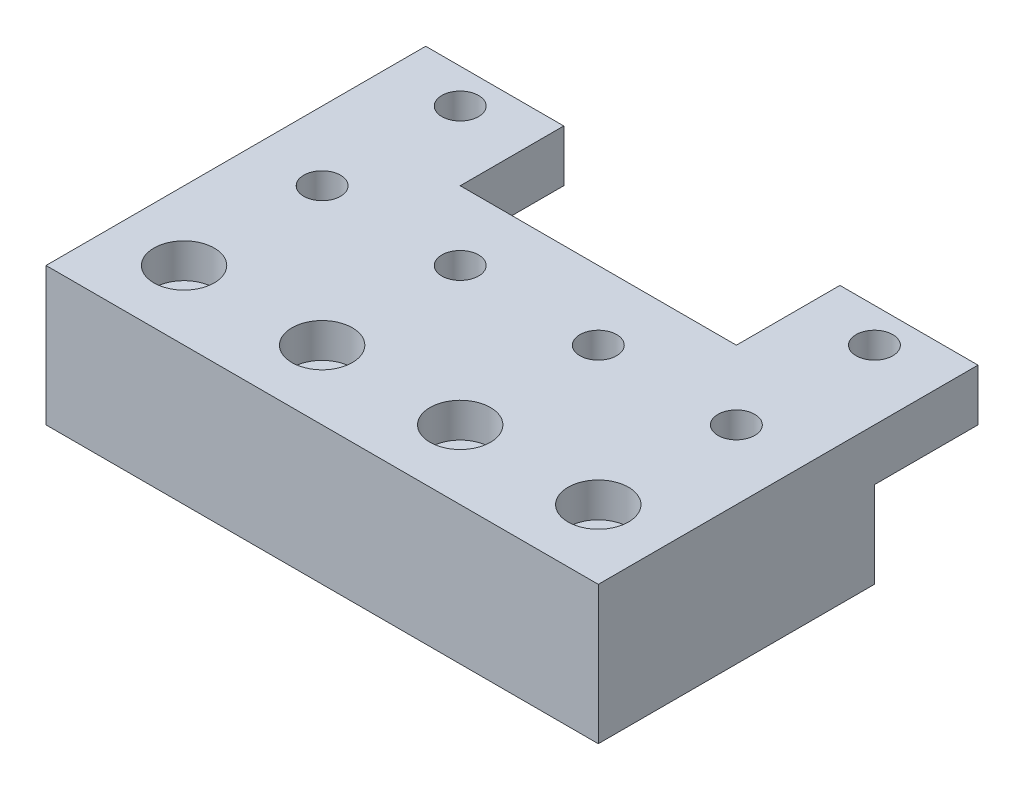
ISO-10303-21;
HEADER;
FILE_DESCRIPTION(('STEP AP214'),'2;1');
FILE_NAME('part.step','',(''),(''),'','','');
FILE_SCHEMA(('AUTOMOTIVE_DESIGN { 1 0 10303 214 1 1 1 1 }'));
ENDSEC;
DATA;
#1=APPLICATION_CONTEXT('core data for automotive mechanical design processes');
#2=APPLICATION_PROTOCOL_DEFINITION('international standard','automotive_design',2000,#1);
#3=PRODUCT_CONTEXT('',#1,'mechanical');
#4=PRODUCT('Part','Part','',(#3));
#5=PRODUCT_RELATED_PRODUCT_CATEGORY('part','',(#4));
#6=PRODUCT_DEFINITION_FORMATION('','',#4);
#7=PRODUCT_DEFINITION_CONTEXT('part definition',#1,'design');
#8=PRODUCT_DEFINITION('design','',#6,#7);
#9=PRODUCT_DEFINITION_SHAPE('','',#8);
#10=(LENGTH_UNIT() NAMED_UNIT(*) SI_UNIT(.MILLI.,.METRE.));
#11=(NAMED_UNIT(*) PLANE_ANGLE_UNIT() SI_UNIT($,.RADIAN.));
#12=(NAMED_UNIT(*) SI_UNIT($,.STERADIAN.) SOLID_ANGLE_UNIT());
#13=UNCERTAINTY_MEASURE_WITH_UNIT(LENGTH_MEASURE(1.E-05),#10,'distance_accuracy_value','');
#14=(GEOMETRIC_REPRESENTATION_CONTEXT(3) GLOBAL_UNCERTAINTY_ASSIGNED_CONTEXT((#13)) GLOBAL_UNIT_ASSIGNED_CONTEXT((#10,
#11,#12)) REPRESENTATION_CONTEXT('',''));
#15=CARTESIAN_POINT('',(0.,0.,0.));
#16=DIRECTION('',(0.,0.,1.));
#17=DIRECTION('',(1.,0.,0.));
#18=AXIS2_PLACEMENT_3D('',#15,#16,#17);
#19=CARTESIAN_POINT('',(0.,25.4,-50.8));
#20=DIRECTION('',(0.,-1.,0.));
#21=DIRECTION('',(0.,0.,-1.));
#22=AXIS2_PLACEMENT_3D('',#19,#20,#21);
#23=PLANE('',#22);
#24=CARTESIAN_POINT('',(12.7,25.4,-63.5));
#25=DIRECTION('',(0.,1.,0.));
#26=DIRECTION('',(0.,0.,1.));
#27=AXIS2_PLACEMENT_3D('',#24,#25,#26);
#28=CIRCLE('',#27,3.3782);
#29=CARTESIAN_POINT('',(12.7,25.4,-60.1218));
#30=VERTEX_POINT('',#29);
#31=EDGE_CURVE('E400',#30,#30,#28,.T.);
#32=ORIENTED_EDGE('',*,*,#31,.F.);
#33=EDGE_LOOP('',(#32));
#34=FACE_BOUND('',#33,.T.);
#35=DIRECTION('',(1.,0.,0.));
#36=VECTOR('',#35,1.);
#37=CARTESIAN_POINT('',(101.6,25.4,-69.85));
#38=LINE('',#37,#36);
#39=CARTESIAN_POINT('',(76.2,25.4,-69.85));
#40=VERTEX_POINT('',#39);
#41=CARTESIAN_POINT('',(101.6,25.4,-69.85));
#42=VERTEX_POINT('',#41);
#43=EDGE_CURVE('E280',#40,#42,#38,.T.);
#44=ORIENTED_EDGE('',*,*,#43,.F.);
#45=DIRECTION('',(0.,0.,-1.));
#46=VECTOR('',#45,1.);
#47=CARTESIAN_POINT('',(76.2,25.4,-50.8));
#48=LINE('',#47,#46);
#49=CARTESIAN_POINT('',(76.2,25.4,-50.8));
#50=VERTEX_POINT('',#49);
#51=EDGE_CURVE('E140',#50,#40,#48,.T.);
#52=ORIENTED_EDGE('',*,*,#51,.F.);
#53=DIRECTION('',(1.,0.,0.));
#54=VECTOR('',#53,1.);
#55=CARTESIAN_POINT('',(76.2,25.4,-50.8));
#56=LINE('',#55,#54);
#57=CARTESIAN_POINT('',(25.4,25.4,-50.8));
#58=VERTEX_POINT('',#57);
#59=EDGE_CURVE('E122',#58,#50,#56,.T.);
#60=ORIENTED_EDGE('',*,*,#59,.F.);
#61=DIRECTION('',(0.,0.,-1.));
#62=VECTOR('',#61,1.);
#63=CARTESIAN_POINT('',(25.4,25.4,-50.8));
#64=LINE('',#63,#62);
#65=CARTESIAN_POINT('',(25.4,25.4,-69.85));
#66=VERTEX_POINT('',#65);
#67=EDGE_CURVE('E271',#58,#66,#64,.T.);
#68=ORIENTED_EDGE('',*,*,#67,.T.);
#69=CARTESIAN_POINT('',(0.,25.4,-69.85));
#70=VERTEX_POINT('',#69);
#71=EDGE_CURVE('E151',#70,#66,#38,.T.);
#72=ORIENTED_EDGE('',*,*,#71,.F.);
#73=DIRECTION('',(0.,0.,1.));
#74=VECTOR('',#73,1.);
#75=CARTESIAN_POINT('',(0.,25.4,0.));
#76=LINE('',#75,#74);
#77=CARTESIAN_POINT('',(0.,25.4,0.));
#78=VERTEX_POINT('',#77);
#79=EDGE_CURVE('E191',#70,#78,#76,.T.);
#80=ORIENTED_EDGE('',*,*,#79,.T.);
#81=DIRECTION('',(1.,0.,0.));
#82=VECTOR('',#81,1.);
#83=CARTESIAN_POINT('',(0.,25.4,0.));
#84=LINE('',#83,#82);
#85=CARTESIAN_POINT('',(101.6,25.4,0.));
#86=VERTEX_POINT('',#85);
#87=EDGE_CURVE('E194',#78,#86,#84,.T.);
#88=ORIENTED_EDGE('',*,*,#87,.T.);
#89=DIRECTION('',(0.,0.,-1.));
#90=VECTOR('',#89,1.);
#91=CARTESIAN_POINT('',(101.6,25.4,0.));
#92=LINE('',#91,#90);
#93=EDGE_CURVE('E197',#86,#42,#92,.T.);
#94=ORIENTED_EDGE('',*,*,#93,.T.);
#95=EDGE_LOOP('',(#44,#52,#60,#68,#72,#80,#88,#94));
#96=FACE_BOUND('',#95,.T.);
#97=CARTESIAN_POINT('',(38.1,25.4,-38.1));
#98=DIRECTION('',(0.,1.,0.));
#99=DIRECTION('',(0.,0.,1.));
#100=AXIS2_PLACEMENT_3D('',#97,#98,#99);
#101=CIRCLE('',#100,3.3782);
#102=CARTESIAN_POINT('',(38.1,25.4,-34.7218));
#103=VERTEX_POINT('',#102);
#104=EDGE_CURVE('E157',#103,#103,#101,.T.);
#105=ORIENTED_EDGE('',*,*,#104,.F.);
#106=EDGE_LOOP('',(#105));
#107=FACE_BOUND('',#106,.T.);
#108=CARTESIAN_POINT('',(12.7,25.4,-38.1));
#109=DIRECTION('',(0.,1.,0.));
#110=DIRECTION('',(0.,0.,1.));
#111=AXIS2_PLACEMENT_3D('',#108,#109,#110);
#112=CIRCLE('',#111,3.3782);
#113=CARTESIAN_POINT('',(12.7,25.4,-34.7218));
#114=VERTEX_POINT('',#113);
#115=EDGE_CURVE('E160',#114,#114,#112,.T.);
#116=ORIENTED_EDGE('',*,*,#115,.F.);
#117=EDGE_LOOP('',(#116));
#118=FACE_BOUND('',#117,.T.);
#119=CARTESIAN_POINT('',(38.1,25.4,-12.7));
#120=DIRECTION('',(0.,1.,0.));
#121=DIRECTION('',(0.,0.,1.));
#122=AXIS2_PLACEMENT_3D('',#119,#120,#121);
#123=CIRCLE('',#122,5.55625);
#124=CARTESIAN_POINT('',(38.1,25.4,-7.14375));
#125=VERTEX_POINT('',#124);
#126=EDGE_CURVE('E166',#125,#125,#123,.T.);
#127=ORIENTED_EDGE('',*,*,#126,.F.);
#128=EDGE_LOOP('',(#127));
#129=FACE_BOUND('',#128,.T.);
#130=CARTESIAN_POINT('',(12.7,25.4,-12.7));
#131=DIRECTION('',(0.,1.,0.));
#132=DIRECTION('',(0.,0.,1.));
#133=AXIS2_PLACEMENT_3D('',#130,#131,#132);
#134=CIRCLE('',#133,5.55625);
#135=CARTESIAN_POINT('',(12.7,25.4,-7.14375));
#136=VERTEX_POINT('',#135);
#137=EDGE_CURVE('E178',#136,#136,#134,.T.);
#138=ORIENTED_EDGE('',*,*,#137,.F.);
#139=EDGE_LOOP('',(#138));
#140=FACE_BOUND('',#139,.T.);
#141=CARTESIAN_POINT('',(63.5,25.4,-12.7));
#142=DIRECTION('',(0.,1.,0.));
#143=DIRECTION('',(0.,0.,1.));
#144=AXIS2_PLACEMENT_3D('',#141,#142,#143);
#145=CIRCLE('',#144,5.55625);
#146=CARTESIAN_POINT('',(63.5,25.4,-7.14375));
#147=VERTEX_POINT('',#146);
#148=EDGE_CURVE('E243',#147,#147,#145,.T.);
#149=ORIENTED_EDGE('',*,*,#148,.F.);
#150=EDGE_LOOP('',(#149));
#151=FACE_BOUND('',#150,.T.);
#152=CARTESIAN_POINT('',(88.9,25.4,-12.7));
#153=DIRECTION('',(0.,1.,0.));
#154=DIRECTION('',(0.,0.,1.));
#155=AXIS2_PLACEMENT_3D('',#152,#153,#154);
#156=CIRCLE('',#155,5.55625);
#157=CARTESIAN_POINT('',(88.9,25.4,-7.14375));
#158=VERTEX_POINT('',#157);
#159=EDGE_CURVE('E231',#158,#158,#156,.T.);
#160=ORIENTED_EDGE('',*,*,#159,.F.);
#161=EDGE_LOOP('',(#160));
#162=FACE_BOUND('',#161,.T.);
#163=CARTESIAN_POINT('',(63.5,25.4,-38.1));
#164=DIRECTION('',(0.,1.,0.));
#165=DIRECTION('',(0.,0.,1.));
#166=AXIS2_PLACEMENT_3D('',#163,#164,#165);
#167=CIRCLE('',#166,3.3782);
#168=CARTESIAN_POINT('',(63.5,25.4,-34.7218));
#169=VERTEX_POINT('',#168);
#170=EDGE_CURVE('E216',#169,#169,#167,.T.);
#171=ORIENTED_EDGE('',*,*,#170,.F.);
#172=EDGE_LOOP('',(#171));
#173=FACE_BOUND('',#172,.T.);
#174=CARTESIAN_POINT('',(88.9,25.4,-38.1));
#175=DIRECTION('',(0.,1.,0.));
#176=DIRECTION('',(0.,0.,1.));
#177=AXIS2_PLACEMENT_3D('',#174,#175,#176);
#178=CIRCLE('',#177,3.3782);
#179=CARTESIAN_POINT('',(88.9,25.4,-34.7218));
#180=VERTEX_POINT('',#179);
#181=EDGE_CURVE('E11',#180,#180,#178,.T.);
#182=ORIENTED_EDGE('',*,*,#181,.F.);
#183=EDGE_LOOP('',(#182));
#184=FACE_BOUND('',#183,.T.);
#185=CARTESIAN_POINT('',(88.9,25.4,-63.5));
#186=DIRECTION('',(0.,1.,0.));
#187=DIRECTION('',(0.,0.,1.));
#188=AXIS2_PLACEMENT_3D('',#185,#186,#187);
#189=CIRCLE('',#188,3.3782);
#190=CARTESIAN_POINT('',(88.9,25.4,-60.1218));
#191=VERTEX_POINT('',#190);
#192=EDGE_CURVE('E395',#191,#191,#189,.T.);
#193=ORIENTED_EDGE('',*,*,#192,.F.);
#194=EDGE_LOOP('',(#193));
#195=FACE_BOUND('',#194,.T.);
#196=ADVANCED_FACE('F34',(#34,#96,#107,#118,#129,#140,#151,#162,#173,#184,#195),#23,.F.);
#197=CARTESIAN_POINT('',(101.6,15.875,-69.85));
#198=DIRECTION('',(0.,1.,0.));
#199=DIRECTION('',(0.,0.,1.));
#200=AXIS2_PLACEMENT_3D('',#197,#198,#199);
#201=PLANE('',#200);
#202=CARTESIAN_POINT('',(88.9,15.875,-63.5));
#203=DIRECTION('',(0.,1.,0.));
#204=DIRECTION('',(0.,0.,1.));
#205=AXIS2_PLACEMENT_3D('',#202,#203,#204);
#206=CIRCLE('',#205,3.3782);
#207=CARTESIAN_POINT('',(88.9,15.875,-60.1218));
#208=VERTEX_POINT('',#207);
#209=EDGE_CURVE('E397',#208,#208,#206,.T.);
#210=ORIENTED_EDGE('',*,*,#209,.T.);
#211=EDGE_LOOP('',(#210));
#212=FACE_BOUND('',#211,.T.);
#213=DIRECTION('',(-1.,0.,0.));
#214=VECTOR('',#213,1.);
#215=CARTESIAN_POINT('',(101.6,15.875,-50.8));
#216=LINE('',#215,#214);
#217=CARTESIAN_POINT('',(101.6,15.875,-50.8));
#218=VERTEX_POINT('',#217);
#219=CARTESIAN_POINT('',(76.2,15.875,-50.8));
#220=VERTEX_POINT('',#219);
#221=EDGE_CURVE('E60',#218,#220,#216,.T.);
#222=ORIENTED_EDGE('',*,*,#221,.T.);
#223=DIRECTION('',(0.,0.,-1.));
#224=VECTOR('',#223,1.);
#225=CARTESIAN_POINT('',(76.2,15.875,-50.8));
#226=LINE('',#225,#224);
#227=CARTESIAN_POINT('',(76.2,15.875,-69.85));
#228=VERTEX_POINT('',#227);
#229=EDGE_CURVE('E114',#220,#228,#226,.T.);
#230=ORIENTED_EDGE('',*,*,#229,.T.);
#231=DIRECTION('',(-1.,0.,0.));
#232=VECTOR('',#231,1.);
#233=CARTESIAN_POINT('',(101.6,15.875,-69.85));
#234=LINE('',#233,#232);
#235=CARTESIAN_POINT('',(101.6,15.875,-69.85));
#236=VERTEX_POINT('',#235);
#237=EDGE_CURVE('E277',#236,#228,#234,.T.);
#238=ORIENTED_EDGE('',*,*,#237,.F.);
#239=DIRECTION('',(0.,0.,1.));
#240=VECTOR('',#239,1.);
#241=CARTESIAN_POINT('',(101.6,15.875,-69.85));
#242=LINE('',#241,#240);
#243=EDGE_CURVE('E134',#236,#218,#242,.T.);
#244=ORIENTED_EDGE('',*,*,#243,.T.);
#245=EDGE_LOOP('',(#222,#230,#238,#244));
#246=FACE_BOUND('',#245,.T.);
#247=ADVANCED_FACE('F132',(#212,#246),#201,.F.);
#248=CARTESIAN_POINT('',(101.6,15.875,-69.85));
#249=DIRECTION('',(0.,0.,-1.));
#250=DIRECTION('',(-1.,0.,0.));
#251=AXIS2_PLACEMENT_3D('',#248,#249,#250);
#252=PLANE('',#251);
#253=DIRECTION('',(0.,-1.,0.));
#254=VECTOR('',#253,1.);
#255=CARTESIAN_POINT('',(76.2,25.4,-69.85));
#256=LINE('',#255,#254);
#257=EDGE_CURVE('E119',#40,#228,#256,.T.);
#258=ORIENTED_EDGE('',*,*,#257,.F.);
#259=ORIENTED_EDGE('',*,*,#43,.T.);
#260=DIRECTION('',(0.,-1.,0.));
#261=VECTOR('',#260,1.);
#262=CARTESIAN_POINT('',(101.6,25.4,-69.85));
#263=LINE('',#262,#261);
#264=EDGE_CURVE('E135',#42,#236,#263,.T.);
#265=ORIENTED_EDGE('',*,*,#264,.T.);
#266=ORIENTED_EDGE('',*,*,#237,.T.);
#267=EDGE_LOOP('',(#258,#259,#265,#266));
#268=FACE_BOUND('',#267,.T.);
#269=ADVANCED_FACE('F297',(#268),#252,.T.);
#270=CARTESIAN_POINT('',(0.,25.4,-50.8));
#271=DIRECTION('',(0.,0.,1.));
#272=DIRECTION('',(1.,0.,0.));
#273=AXIS2_PLACEMENT_3D('',#270,#271,#272);
#274=PLANE('',#273);
#275=ORIENTED_EDGE('',*,*,#221,.F.);
#276=DIRECTION('',(0.,-1.,0.));
#277=VECTOR('',#276,1.);
#278=CARTESIAN_POINT('',(101.6,25.4,-50.8));
#279=LINE('',#278,#277);
#280=CARTESIAN_POINT('',(101.6,0.,-50.8));
#281=VERTEX_POINT('',#280);
#282=EDGE_CURVE('E143',#218,#281,#279,.T.);
#283=ORIENTED_EDGE('',*,*,#282,.T.);
#284=DIRECTION('',(-1.,0.,0.));
#285=VECTOR('',#284,1.);
#286=CARTESIAN_POINT('',(0.,0.,-50.8));
#287=LINE('',#286,#285);
#288=CARTESIAN_POINT('',(0.,0.,-50.8));
#289=VERTEX_POINT('',#288);
#290=EDGE_CURVE('E195',#281,#289,#287,.T.);
#291=ORIENTED_EDGE('',*,*,#290,.T.);
#292=DIRECTION('',(0.,-1.,0.));
#293=VECTOR('',#292,1.);
#294=CARTESIAN_POINT('',(0.,25.4,-50.8));
#295=LINE('',#294,#293);
#296=CARTESIAN_POINT('',(0.,15.875,-50.8));
#297=VERTEX_POINT('',#296);
#298=EDGE_CURVE('E200',#297,#289,#295,.T.);
#299=ORIENTED_EDGE('',*,*,#298,.F.);
#300=CARTESIAN_POINT('',(25.4,15.875,-50.8));
#301=VERTEX_POINT('',#300);
#302=EDGE_CURVE('E38',#301,#297,#216,.T.);
#303=ORIENTED_EDGE('',*,*,#302,.F.);
#304=DIRECTION('',(0.,1.,0.));
#305=VECTOR('',#304,1.);
#306=CARTESIAN_POINT('',(25.4,25.4,-50.8));
#307=LINE('',#306,#305);
#308=EDGE_CURVE('E128',#301,#58,#307,.T.);
#309=ORIENTED_EDGE('',*,*,#308,.T.);
#310=ORIENTED_EDGE('',*,*,#59,.T.);
#311=DIRECTION('',(0.,-1.,0.));
#312=VECTOR('',#311,1.);
#313=CARTESIAN_POINT('',(76.2,25.4,-50.8));
#314=LINE('',#313,#312);
#315=EDGE_CURVE('E116',#50,#220,#314,.T.);
#316=ORIENTED_EDGE('',*,*,#315,.T.);
#317=EDGE_LOOP('',(#275,#283,#291,#299,#303,#309,#310,#316));
#318=FACE_BOUND('',#317,.T.);
#319=ADVANCED_FACE('F124',(#318),#274,.F.);
#320=CARTESIAN_POINT('',(0.,25.4,0.));
#321=DIRECTION('',(1.,0.,0.));
#322=DIRECTION('',(0.,0.,-1.));
#323=AXIS2_PLACEMENT_3D('',#320,#321,#322);
#324=PLANE('',#323);
#325=DIRECTION('',(0.,0.,1.));
#326=VECTOR('',#325,1.);
#327=CARTESIAN_POINT('',(0.,0.,0.));
#328=LINE('',#327,#326);
#329=CARTESIAN_POINT('',(0.,0.,0.));
#330=VERTEX_POINT('',#329);
#331=EDGE_CURVE('E190',#289,#330,#328,.T.);
#332=ORIENTED_EDGE('',*,*,#331,.T.);
#333=DIRECTION('',(0.,-1.,0.));
#334=VECTOR('',#333,1.);
#335=CARTESIAN_POINT('',(0.,25.4,0.));
#336=LINE('',#335,#334);
#337=EDGE_CURVE('E246',#78,#330,#336,.T.);
#338=ORIENTED_EDGE('',*,*,#337,.F.);
#339=ORIENTED_EDGE('',*,*,#79,.F.);
#340=DIRECTION('',(0.,1.,0.));
#341=VECTOR('',#340,1.);
#342=CARTESIAN_POINT('',(0.,25.4,-69.85));
#343=LINE('',#342,#341);
#344=CARTESIAN_POINT('',(0.,15.875,-69.85));
#345=VERTEX_POINT('',#344);
#346=EDGE_CURVE('E278',#345,#70,#343,.T.);
#347=ORIENTED_EDGE('',*,*,#346,.F.);
#348=DIRECTION('',(0.,0.,1.));
#349=VECTOR('',#348,1.);
#350=CARTESIAN_POINT('',(0.,15.875,-69.85));
#351=LINE('',#350,#349);
#352=EDGE_CURVE('E146',#345,#297,#351,.T.);
#353=ORIENTED_EDGE('',*,*,#352,.T.);
#354=ORIENTED_EDGE('',*,*,#298,.T.);
#355=EDGE_LOOP('',(#332,#338,#339,#347,#353,#354));
#356=FACE_BOUND('',#355,.T.);
#357=ADVANCED_FACE('F263',(#356),#324,.F.);
#358=CARTESIAN_POINT('',(0.,25.4,0.));
#359=DIRECTION('',(0.,0.,-1.));
#360=DIRECTION('',(-1.,0.,0.));
#361=AXIS2_PLACEMENT_3D('',#358,#359,#360);
#362=PLANE('',#361);
#363=DIRECTION('',(1.,0.,0.));
#364=VECTOR('',#363,1.);
#365=CARTESIAN_POINT('',(0.,0.,0.));
#366=LINE('',#365,#364);
#367=CARTESIAN_POINT('',(101.6,0.,0.));
#368=VERTEX_POINT('',#367);
#369=EDGE_CURVE('E203',#330,#368,#366,.T.);
#370=ORIENTED_EDGE('',*,*,#369,.T.);
#371=DIRECTION('',(0.,-1.,0.));
#372=VECTOR('',#371,1.);
#373=CARTESIAN_POINT('',(101.6,25.4,0.));
#374=LINE('',#373,#372);
#375=EDGE_CURVE('E248',#86,#368,#374,.T.);
#376=ORIENTED_EDGE('',*,*,#375,.F.);
#377=ORIENTED_EDGE('',*,*,#87,.F.);
#378=ORIENTED_EDGE('',*,*,#337,.T.);
#379=EDGE_LOOP('',(#370,#376,#377,#378));
#380=FACE_BOUND('',#379,.T.);
#381=ADVANCED_FACE('F300',(#380),#362,.F.);
#382=CARTESIAN_POINT('',(101.6,25.4,0.));
#383=DIRECTION('',(-1.,0.,0.));
#384=DIRECTION('',(0.,0.,1.));
#385=AXIS2_PLACEMENT_3D('',#382,#383,#384);
#386=PLANE('',#385);
#387=DIRECTION('',(0.,0.,-1.));
#388=VECTOR('',#387,1.);
#389=CARTESIAN_POINT('',(101.6,0.,0.));
#390=LINE('',#389,#388);
#391=EDGE_CURVE('E205',#368,#281,#390,.T.);
#392=ORIENTED_EDGE('',*,*,#391,.T.);
#393=ORIENTED_EDGE('',*,*,#282,.F.);
#394=ORIENTED_EDGE('',*,*,#243,.F.);
#395=ORIENTED_EDGE('',*,*,#264,.F.);
#396=ORIENTED_EDGE('',*,*,#93,.F.);
#397=ORIENTED_EDGE('',*,*,#375,.T.);
#398=EDGE_LOOP('',(#392,#393,#394,#395,#396,#397));
#399=FACE_BOUND('',#398,.T.);
#400=ADVANCED_FACE('F257',(#399),#386,.F.);
#401=CARTESIAN_POINT('',(0.,0.,-50.8));
#402=DIRECTION('',(0.,-1.,0.));
#403=DIRECTION('',(0.,0.,-1.));
#404=AXIS2_PLACEMENT_3D('',#401,#402,#403);
#405=PLANE('',#404);
#406=CARTESIAN_POINT('',(38.1,0.,-38.1));
#407=DIRECTION('',(0.,1.,0.));
#408=DIRECTION('',(0.,0.,1.));
#409=AXIS2_PLACEMENT_3D('',#406,#407,#408);
#410=CIRCLE('',#409,3.37819999999999);
#411=CARTESIAN_POINT('',(38.1,0.,-34.7218));
#412=VERTEX_POINT('',#411);
#413=EDGE_CURVE('E153',#412,#412,#410,.T.);
#414=ORIENTED_EDGE('',*,*,#413,.T.);
#415=EDGE_LOOP('',(#414));
#416=FACE_BOUND('',#415,.T.);
#417=CARTESIAN_POINT('',(12.7,0.,-38.1));
#418=DIRECTION('',(0.,1.,0.));
#419=DIRECTION('',(0.,0.,1.));
#420=AXIS2_PLACEMENT_3D('',#417,#418,#419);
#421=CIRCLE('',#420,3.37819999999999);
#422=CARTESIAN_POINT('',(12.7,0.,-34.7218));
#423=VERTEX_POINT('',#422);
#424=EDGE_CURVE('E163',#423,#423,#421,.T.);
#425=ORIENTED_EDGE('',*,*,#424,.T.);
#426=EDGE_LOOP('',(#425));
#427=FACE_BOUND('',#426,.T.);
#428=CARTESIAN_POINT('',(38.1,0.,-12.7));
#429=DIRECTION('',(0.,1.,0.));
#430=DIRECTION('',(0.,0.,1.));
#431=AXIS2_PLACEMENT_3D('',#428,#429,#430);
#432=CIRCLE('',#431,3.37819999999999);
#433=CARTESIAN_POINT('',(38.1,0.,-9.3218));
#434=VERTEX_POINT('',#433);
#435=EDGE_CURVE('E169',#434,#434,#432,.T.);
#436=ORIENTED_EDGE('',*,*,#435,.T.);
#437=EDGE_LOOP('',(#436));
#438=FACE_BOUND('',#437,.T.);
#439=CARTESIAN_POINT('',(12.7,0.,-12.7));
#440=DIRECTION('',(0.,1.,0.));
#441=DIRECTION('',(0.,0.,1.));
#442=AXIS2_PLACEMENT_3D('',#439,#440,#441);
#443=CIRCLE('',#442,3.37819999999999);
#444=CARTESIAN_POINT('',(12.7,0.,-9.3218));
#445=VERTEX_POINT('',#444);
#446=EDGE_CURVE('E187',#445,#445,#443,.T.);
#447=ORIENTED_EDGE('',*,*,#446,.T.);
#448=EDGE_LOOP('',(#447));
#449=FACE_BOUND('',#448,.T.);
#450=ORIENTED_EDGE('',*,*,#331,.F.);
#451=ORIENTED_EDGE('',*,*,#290,.F.);
#452=ORIENTED_EDGE('',*,*,#391,.F.);
#453=ORIENTED_EDGE('',*,*,#369,.F.);
#454=EDGE_LOOP('',(#450,#451,#452,#453));
#455=FACE_BOUND('',#454,.T.);
#456=CARTESIAN_POINT('',(63.5,0.,-12.7));
#457=DIRECTION('',(0.,1.,0.));
#458=DIRECTION('',(0.,0.,1.));
#459=AXIS2_PLACEMENT_3D('',#456,#457,#458);
#460=CIRCLE('',#459,3.37819999999999);
#461=CARTESIAN_POINT('',(63.5,0.,-9.3218));
#462=VERTEX_POINT('',#461);
#463=EDGE_CURVE('E240',#462,#462,#460,.T.);
#464=ORIENTED_EDGE('',*,*,#463,.T.);
#465=EDGE_LOOP('',(#464));
#466=FACE_BOUND('',#465,.T.);
#467=CARTESIAN_POINT('',(88.9,0.,-12.7));
#468=DIRECTION('',(0.,1.,0.));
#469=DIRECTION('',(0.,0.,1.));
#470=AXIS2_PLACEMENT_3D('',#467,#468,#469);
#471=CIRCLE('',#470,3.37819999999999);
#472=CARTESIAN_POINT('',(88.9,0.,-9.3218));
#473=VERTEX_POINT('',#472);
#474=EDGE_CURVE('E228',#473,#473,#471,.T.);
#475=ORIENTED_EDGE('',*,*,#474,.T.);
#476=EDGE_LOOP('',(#475));
#477=FACE_BOUND('',#476,.T.);
#478=CARTESIAN_POINT('',(63.5,0.,-38.1));
#479=DIRECTION('',(0.,1.,0.));
#480=DIRECTION('',(0.,0.,1.));
#481=AXIS2_PLACEMENT_3D('',#478,#479,#480);
#482=CIRCLE('',#481,3.37819999999999);
#483=CARTESIAN_POINT('',(63.5,0.,-34.7218));
#484=VERTEX_POINT('',#483);
#485=EDGE_CURVE('E219',#484,#484,#482,.T.);
#486=ORIENTED_EDGE('',*,*,#485,.T.);
#487=EDGE_LOOP('',(#486));
#488=FACE_BOUND('',#487,.T.);
#489=CARTESIAN_POINT('',(88.9,0.,-38.1));
#490=DIRECTION('',(0.,1.,0.));
#491=DIRECTION('',(0.,0.,1.));
#492=AXIS2_PLACEMENT_3D('',#489,#490,#491);
#493=CIRCLE('',#492,3.37819999999999);
#494=CARTESIAN_POINT('',(88.9,0.,-34.7218));
#495=VERTEX_POINT('',#494);
#496=EDGE_CURVE('E44',#495,#495,#493,.T.);
#497=ORIENTED_EDGE('',*,*,#496,.T.);
#498=EDGE_LOOP('',(#497));
#499=FACE_BOUND('',#498,.T.);
#500=ADVANCED_FACE('F259',(#416,#427,#438,#449,#455,#466,#477,#488,#499),#405,.T.);
#501=CARTESIAN_POINT('',(12.7,25.4,-12.7));
#502=DIRECTION('',(0.,1.,0.));
#503=DIRECTION('',(0.,0.,1.));
#504=AXIS2_PLACEMENT_3D('',#501,#502,#503);
#505=CYLINDRICAL_SURFACE('',#504,3.3782);
#506=ORIENTED_EDGE('',*,*,#446,.F.);
#507=EDGE_LOOP('',(#506));
#508=FACE_BOUND('',#507,.T.);
#509=CARTESIAN_POINT('',(12.7,19.05,-12.7));
#510=DIRECTION('',(0.,1.,0.));
#511=DIRECTION('',(0.,0.,1.));
#512=AXIS2_PLACEMENT_3D('',#509,#510,#511);
#513=CIRCLE('',#512,3.3782);
#514=CARTESIAN_POINT('',(12.7,19.05,-9.3218));
#515=VERTEX_POINT('',#514);
#516=EDGE_CURVE('E184',#515,#515,#513,.T.);
#517=ORIENTED_EDGE('',*,*,#516,.T.);
#518=EDGE_LOOP('',(#517));
#519=FACE_BOUND('',#518,.T.);
#520=ADVANCED_FACE('F320',(#508,#519),#505,.F.);
#521=CARTESIAN_POINT('',(16.0782,19.05,-12.7));
#522=DIRECTION('',(0.,-1.,0.));
#523=DIRECTION('',(0.,0.,-1.));
#524=AXIS2_PLACEMENT_3D('',#521,#522,#523);
#525=PLANE('',#524);
#526=ORIENTED_EDGE('',*,*,#516,.F.);
#527=EDGE_LOOP('',(#526));
#528=FACE_BOUND('',#527,.T.);
#529=CARTESIAN_POINT('',(12.7,19.05,-12.7));
#530=DIRECTION('',(0.,1.,0.));
#531=DIRECTION('',(0.,0.,1.));
#532=AXIS2_PLACEMENT_3D('',#529,#530,#531);
#533=CIRCLE('',#532,5.55625);
#534=CARTESIAN_POINT('',(12.7,19.05,-7.14375));
#535=VERTEX_POINT('',#534);
#536=EDGE_CURVE('E181',#535,#535,#533,.T.);
#537=ORIENTED_EDGE('',*,*,#536,.T.);
#538=EDGE_LOOP('',(#537));
#539=FACE_BOUND('',#538,.T.);
#540=ADVANCED_FACE('F370',(#528,#539),#525,.F.);
#541=CARTESIAN_POINT('',(12.7,25.4,-12.7));
#542=DIRECTION('',(0.,1.,0.));
#543=DIRECTION('',(0.,0.,1.));
#544=AXIS2_PLACEMENT_3D('',#541,#542,#543);
#545=CYLINDRICAL_SURFACE('',#544,5.55625);
#546=ORIENTED_EDGE('',*,*,#536,.F.);
#547=EDGE_LOOP('',(#546));
#548=FACE_BOUND('',#547,.T.);
#549=ORIENTED_EDGE('',*,*,#137,.T.);
#550=EDGE_LOOP('',(#549));
#551=FACE_BOUND('',#550,.T.);
#552=ADVANCED_FACE('F361',(#548,#551),#545,.F.);
#553=CARTESIAN_POINT('',(38.1,25.4,-12.7));
#554=DIRECTION('',(0.,1.,0.));
#555=DIRECTION('',(0.,0.,1.));
#556=AXIS2_PLACEMENT_3D('',#553,#554,#555);
#557=CYLINDRICAL_SURFACE('',#556,3.3782);
#558=ORIENTED_EDGE('',*,*,#435,.F.);
#559=EDGE_LOOP('',(#558));
#560=FACE_BOUND('',#559,.T.);
#561=CARTESIAN_POINT('',(38.1,19.05,-12.7));
#562=DIRECTION('',(0.,1.,0.));
#563=DIRECTION('',(0.,0.,1.));
#564=AXIS2_PLACEMENT_3D('',#561,#562,#563);
#565=CIRCLE('',#564,3.3782);
#566=CARTESIAN_POINT('',(38.1,19.05,-9.3218));
#567=VERTEX_POINT('',#566);
#568=EDGE_CURVE('E175',#567,#567,#565,.T.);
#569=ORIENTED_EDGE('',*,*,#568,.T.);
#570=EDGE_LOOP('',(#569));
#571=FACE_BOUND('',#570,.T.);
#572=ADVANCED_FACE('F364',(#560,#571),#557,.F.);
#573=CARTESIAN_POINT('',(41.4782,19.05,-12.7));
#574=DIRECTION('',(0.,-1.,0.));
#575=DIRECTION('',(0.,0.,-1.));
#576=AXIS2_PLACEMENT_3D('',#573,#574,#575);
#577=PLANE('',#576);
#578=ORIENTED_EDGE('',*,*,#568,.F.);
#579=EDGE_LOOP('',(#578));
#580=FACE_BOUND('',#579,.T.);
#581=CARTESIAN_POINT('',(38.1,19.05,-12.7));
#582=DIRECTION('',(0.,1.,0.));
#583=DIRECTION('',(0.,0.,1.));
#584=AXIS2_PLACEMENT_3D('',#581,#582,#583);
#585=CIRCLE('',#584,5.55625);
#586=CARTESIAN_POINT('',(38.1,19.05,-7.14375));
#587=VERTEX_POINT('',#586);
#588=EDGE_CURVE('E172',#587,#587,#585,.T.);
#589=ORIENTED_EDGE('',*,*,#588,.T.);
#590=EDGE_LOOP('',(#589));
#591=FACE_BOUND('',#590,.T.);
#592=ADVANCED_FACE('F359',(#580,#591),#577,.F.);
#593=CARTESIAN_POINT('',(38.1,25.4,-12.7));
#594=DIRECTION('',(0.,1.,0.));
#595=DIRECTION('',(0.,0.,1.));
#596=AXIS2_PLACEMENT_3D('',#593,#594,#595);
#597=CYLINDRICAL_SURFACE('',#596,5.55625);
#598=ORIENTED_EDGE('',*,*,#588,.F.);
#599=EDGE_LOOP('',(#598));
#600=FACE_BOUND('',#599,.T.);
#601=ORIENTED_EDGE('',*,*,#126,.T.);
#602=EDGE_LOOP('',(#601));
#603=FACE_BOUND('',#602,.T.);
#604=ADVANCED_FACE('F355',(#600,#603),#597,.F.);
#605=CARTESIAN_POINT('',(63.5,25.4,-12.7));
#606=DIRECTION('',(0.,1.,0.));
#607=DIRECTION('',(0.,0.,1.));
#608=AXIS2_PLACEMENT_3D('',#605,#606,#607);
#609=CYLINDRICAL_SURFACE('',#608,5.55625);
#610=CARTESIAN_POINT('',(63.5,19.05,-12.7));
#611=DIRECTION('',(0.,1.,0.));
#612=DIRECTION('',(0.,0.,1.));
#613=AXIS2_PLACEMENT_3D('',#610,#611,#612);
#614=CIRCLE('',#613,5.55625);
#615=CARTESIAN_POINT('',(63.5,19.05,-7.14375));
#616=VERTEX_POINT('',#615);
#617=EDGE_CURVE('E234',#616,#616,#614,.T.);
#618=ORIENTED_EDGE('',*,*,#617,.F.);
#619=EDGE_LOOP('',(#618));
#620=FACE_BOUND('',#619,.T.);
#621=ORIENTED_EDGE('',*,*,#148,.T.);
#622=EDGE_LOOP('',(#621));
#623=FACE_BOUND('',#622,.T.);
#624=ADVANCED_FACE('F358',(#620,#623),#609,.F.);
#625=CARTESIAN_POINT('',(66.8782,19.05,-12.7));
#626=DIRECTION('',(0.,-1.,0.));
#627=DIRECTION('',(0.,0.,-1.));
#628=AXIS2_PLACEMENT_3D('',#625,#626,#627);
#629=PLANE('',#628);
#630=CARTESIAN_POINT('',(63.5,19.05,-12.7));
#631=DIRECTION('',(0.,1.,0.));
#632=DIRECTION('',(0.,0.,1.));
#633=AXIS2_PLACEMENT_3D('',#630,#631,#632);
#634=CIRCLE('',#633,3.3782);
#635=CARTESIAN_POINT('',(63.5,19.05,-9.3218));
#636=VERTEX_POINT('',#635);
#637=EDGE_CURVE('E237',#636,#636,#634,.T.);
#638=ORIENTED_EDGE('',*,*,#637,.F.);
#639=EDGE_LOOP('',(#638));
#640=FACE_BOUND('',#639,.T.);
#641=ORIENTED_EDGE('',*,*,#617,.T.);
#642=EDGE_LOOP('',(#641));
#643=FACE_BOUND('',#642,.T.);
#644=ADVANCED_FACE('F526',(#640,#643),#629,.F.);
#645=CARTESIAN_POINT('',(63.5,25.4,-12.7));
#646=DIRECTION('',(0.,1.,0.));
#647=DIRECTION('',(0.,0.,1.));
#648=AXIS2_PLACEMENT_3D('',#645,#646,#647);
#649=CYLINDRICAL_SURFACE('',#648,3.3782);
#650=ORIENTED_EDGE('',*,*,#463,.F.);
#651=EDGE_LOOP('',(#650));
#652=FACE_BOUND('',#651,.T.);
#653=ORIENTED_EDGE('',*,*,#637,.T.);
#654=EDGE_LOOP('',(#653));
#655=FACE_BOUND('',#654,.T.);
#656=ADVANCED_FACE('F516',(#652,#655),#649,.F.);
#657=CARTESIAN_POINT('',(88.9,25.4,-12.7));
#658=DIRECTION('',(0.,1.,0.));
#659=DIRECTION('',(0.,0.,1.));
#660=AXIS2_PLACEMENT_3D('',#657,#658,#659);
#661=CYLINDRICAL_SURFACE('',#660,5.55625);
#662=CARTESIAN_POINT('',(88.9,19.05,-12.7));
#663=DIRECTION('',(0.,1.,0.));
#664=DIRECTION('',(0.,0.,1.));
#665=AXIS2_PLACEMENT_3D('',#662,#663,#664);
#666=CIRCLE('',#665,5.55625);
#667=CARTESIAN_POINT('',(88.9,19.05,-7.14375));
#668=VERTEX_POINT('',#667);
#669=EDGE_CURVE('E222',#668,#668,#666,.T.);
#670=ORIENTED_EDGE('',*,*,#669,.F.);
#671=EDGE_LOOP('',(#670));
#672=FACE_BOUND('',#671,.T.);
#673=ORIENTED_EDGE('',*,*,#159,.T.);
#674=EDGE_LOOP('',(#673));
#675=FACE_BOUND('',#674,.T.);
#676=ADVANCED_FACE('F506',(#672,#675),#661,.F.);
#677=CARTESIAN_POINT('',(92.2782,19.05,-12.7));
#678=DIRECTION('',(0.,-1.,0.));
#679=DIRECTION('',(0.,0.,-1.));
#680=AXIS2_PLACEMENT_3D('',#677,#678,#679);
#681=PLANE('',#680);
#682=CARTESIAN_POINT('',(88.9,19.05,-12.7));
#683=DIRECTION('',(0.,1.,0.));
#684=DIRECTION('',(0.,0.,1.));
#685=AXIS2_PLACEMENT_3D('',#682,#683,#684);
#686=CIRCLE('',#685,3.3782);
#687=CARTESIAN_POINT('',(88.9,19.05,-9.3218));
#688=VERTEX_POINT('',#687);
#689=EDGE_CURVE('E225',#688,#688,#686,.T.);
#690=ORIENTED_EDGE('',*,*,#689,.F.);
#691=EDGE_LOOP('',(#690));
#692=FACE_BOUND('',#691,.T.);
#693=ORIENTED_EDGE('',*,*,#669,.T.);
#694=EDGE_LOOP('',(#693));
#695=FACE_BOUND('',#694,.T.);
#696=ADVANCED_FACE('F496',(#692,#695),#681,.F.);
#697=CARTESIAN_POINT('',(88.9,25.4,-12.7));
#698=DIRECTION('',(0.,1.,0.));
#699=DIRECTION('',(0.,0.,1.));
#700=AXIS2_PLACEMENT_3D('',#697,#698,#699);
#701=CYLINDRICAL_SURFACE('',#700,3.3782);
#702=ORIENTED_EDGE('',*,*,#474,.F.);
#703=EDGE_LOOP('',(#702));
#704=FACE_BOUND('',#703,.T.);
#705=ORIENTED_EDGE('',*,*,#689,.T.);
#706=EDGE_LOOP('',(#705));
#707=FACE_BOUND('',#706,.T.);
#708=ADVANCED_FACE('F353',(#704,#707),#701,.F.);
#709=CARTESIAN_POINT('',(12.7,25.4,-38.1));
#710=DIRECTION('',(0.,1.,0.));
#711=DIRECTION('',(0.,0.,1.));
#712=AXIS2_PLACEMENT_3D('',#709,#710,#711);
#713=CYLINDRICAL_SURFACE('',#712,3.3782);
#714=ORIENTED_EDGE('',*,*,#424,.F.);
#715=EDGE_LOOP('',(#714));
#716=FACE_BOUND('',#715,.T.);
#717=ORIENTED_EDGE('',*,*,#115,.T.);
#718=EDGE_LOOP('',(#717));
#719=FACE_BOUND('',#718,.T.);
#720=ADVANCED_FACE('F349',(#716,#719),#713,.F.);
#721=CARTESIAN_POINT('',(38.1,25.4,-38.1));
#722=DIRECTION('',(0.,1.,0.));
#723=DIRECTION('',(0.,0.,1.));
#724=AXIS2_PLACEMENT_3D('',#721,#722,#723);
#725=CYLINDRICAL_SURFACE('',#724,3.3782);
#726=ORIENTED_EDGE('',*,*,#413,.F.);
#727=EDGE_LOOP('',(#726));
#728=FACE_BOUND('',#727,.T.);
#729=ORIENTED_EDGE('',*,*,#104,.T.);
#730=EDGE_LOOP('',(#729));
#731=FACE_BOUND('',#730,.T.);
#732=ADVANCED_FACE('F346',(#728,#731),#725,.F.);
#733=CARTESIAN_POINT('',(63.5,25.4,-38.1));
#734=DIRECTION('',(0.,1.,0.));
#735=DIRECTION('',(0.,0.,1.));
#736=AXIS2_PLACEMENT_3D('',#733,#734,#735);
#737=CYLINDRICAL_SURFACE('',#736,3.3782);
#738=ORIENTED_EDGE('',*,*,#485,.F.);
#739=EDGE_LOOP('',(#738));
#740=FACE_BOUND('',#739,.T.);
#741=ORIENTED_EDGE('',*,*,#170,.T.);
#742=EDGE_LOOP('',(#741));
#743=FACE_BOUND('',#742,.T.);
#744=ADVANCED_FACE('F342',(#740,#743),#737,.F.);
#745=CARTESIAN_POINT('',(88.9,25.4,-38.1));
#746=DIRECTION('',(0.,1.,0.));
#747=DIRECTION('',(0.,0.,1.));
#748=AXIS2_PLACEMENT_3D('',#745,#746,#747);
#749=CYLINDRICAL_SURFACE('',#748,3.3782);
#750=ORIENTED_EDGE('',*,*,#496,.F.);
#751=EDGE_LOOP('',(#750));
#752=FACE_BOUND('',#751,.T.);
#753=ORIENTED_EDGE('',*,*,#181,.T.);
#754=EDGE_LOOP('',(#753));
#755=FACE_BOUND('',#754,.T.);
#756=ADVANCED_FACE('F36',(#752,#755),#749,.F.);
#757=CARTESIAN_POINT('',(12.7,15.875,-63.5));
#758=DIRECTION('',(0.,1.,0.));
#759=DIRECTION('',(0.,0.,1.));
#760=AXIS2_PLACEMENT_3D('',#757,#758,#759);
#761=CIRCLE('',#760,3.3782);
#762=CARTESIAN_POINT('',(12.7,15.875,-60.1218));
#763=VERTEX_POINT('',#762);
#764=EDGE_CURVE('E294',#763,#763,#761,.T.);
#765=ORIENTED_EDGE('',*,*,#764,.T.);
#766=EDGE_LOOP('',(#765));
#767=FACE_BOUND('',#766,.T.);
#768=CARTESIAN_POINT('',(25.4,15.875,-69.85));
#769=VERTEX_POINT('',#768);
#770=EDGE_CURVE('E138',#769,#345,#234,.T.);
#771=ORIENTED_EDGE('',*,*,#770,.F.);
#772=DIRECTION('',(0.,0.,-1.));
#773=VECTOR('',#772,1.);
#774=CARTESIAN_POINT('',(25.4,15.875,-50.8));
#775=LINE('',#774,#773);
#776=EDGE_CURVE('E52',#301,#769,#775,.T.);
#777=ORIENTED_EDGE('',*,*,#776,.F.);
#778=ORIENTED_EDGE('',*,*,#302,.T.);
#779=ORIENTED_EDGE('',*,*,#352,.F.);
#780=EDGE_LOOP('',(#771,#777,#778,#779));
#781=FACE_BOUND('',#780,.T.);
#782=ADVANCED_FACE('F270',(#767,#781),#201,.F.);
#783=DIRECTION('',(0.,1.,0.));
#784=VECTOR('',#783,1.);
#785=CARTESIAN_POINT('',(25.4,25.4,-69.85));
#786=LINE('',#785,#784);
#787=EDGE_CURVE('E129',#769,#66,#786,.T.);
#788=ORIENTED_EDGE('',*,*,#787,.F.);
#789=ORIENTED_EDGE('',*,*,#770,.T.);
#790=ORIENTED_EDGE('',*,*,#346,.T.);
#791=ORIENTED_EDGE('',*,*,#71,.T.);
#792=EDGE_LOOP('',(#788,#789,#790,#791));
#793=FACE_BOUND('',#792,.T.);
#794=ADVANCED_FACE('F289',(#793),#252,.T.);
#795=CARTESIAN_POINT('',(76.2,25.4,-50.8));
#796=DIRECTION('',(1.,0.,0.));
#797=DIRECTION('',(0.,0.,-1.));
#798=AXIS2_PLACEMENT_3D('',#795,#796,#797);
#799=PLANE('',#798);
#800=ORIENTED_EDGE('',*,*,#257,.T.);
#801=ORIENTED_EDGE('',*,*,#229,.F.);
#802=ORIENTED_EDGE('',*,*,#315,.F.);
#803=ORIENTED_EDGE('',*,*,#51,.T.);
#804=EDGE_LOOP('',(#800,#801,#802,#803));
#805=FACE_BOUND('',#804,.T.);
#806=ADVANCED_FACE('F115',(#805),#799,.F.);
#807=CARTESIAN_POINT('',(25.4,25.4,-50.8));
#808=DIRECTION('',(-1.,0.,0.));
#809=DIRECTION('',(0.,-1.,0.));
#810=AXIS2_PLACEMENT_3D('',#807,#808,#809);
#811=PLANE('',#810);
#812=ORIENTED_EDGE('',*,*,#787,.T.);
#813=ORIENTED_EDGE('',*,*,#67,.F.);
#814=ORIENTED_EDGE('',*,*,#308,.F.);
#815=ORIENTED_EDGE('',*,*,#776,.T.);
#816=EDGE_LOOP('',(#812,#813,#814,#815));
#817=FACE_BOUND('',#816,.T.);
#818=ADVANCED_FACE('F292',(#817),#811,.F.);
#819=CARTESIAN_POINT('',(12.7,25.4,-63.5));
#820=DIRECTION('',(0.,1.,0.));
#821=DIRECTION('',(0.,0.,1.));
#822=AXIS2_PLACEMENT_3D('',#819,#820,#821);
#823=CYLINDRICAL_SURFACE('',#822,3.3782);
#824=ORIENTED_EDGE('',*,*,#31,.T.);
#825=EDGE_LOOP('',(#824));
#826=FACE_BOUND('',#825,.T.);
#827=ORIENTED_EDGE('',*,*,#764,.F.);
#828=EDGE_LOOP('',(#827));
#829=FACE_BOUND('',#828,.T.);
#830=ADVANCED_FACE('F408',(#826,#829),#823,.F.);
#831=CARTESIAN_POINT('',(88.9,25.4,-63.5));
#832=DIRECTION('',(0.,1.,0.));
#833=DIRECTION('',(0.,0.,1.));
#834=AXIS2_PLACEMENT_3D('',#831,#832,#833);
#835=CYLINDRICAL_SURFACE('',#834,3.3782);
#836=ORIENTED_EDGE('',*,*,#192,.T.);
#837=EDGE_LOOP('',(#836));
#838=FACE_BOUND('',#837,.T.);
#839=ORIENTED_EDGE('',*,*,#209,.F.);
#840=EDGE_LOOP('',(#839));
#841=FACE_BOUND('',#840,.T.);
#842=ADVANCED_FACE('F410',(#838,#841),#835,.F.);
#843=CLOSED_SHELL('',(#196,#247,#269,#319,#357,#381,#400,#500,#520,#540,#552,#572,#592,#604,
#624,#644,#656,#676,#696,#708,#720,#732,#744,#756,#782,#794,#806,#818,#830,#842));
#844=MANIFOLD_SOLID_BREP('B2',#843);
#845=ADVANCED_BREP_SHAPE_REPRESENTATION('',(#18,#844),#14);
#846=SHAPE_DEFINITION_REPRESENTATION(#9,#845);
ENDSEC;
END-ISO-10303-21;
